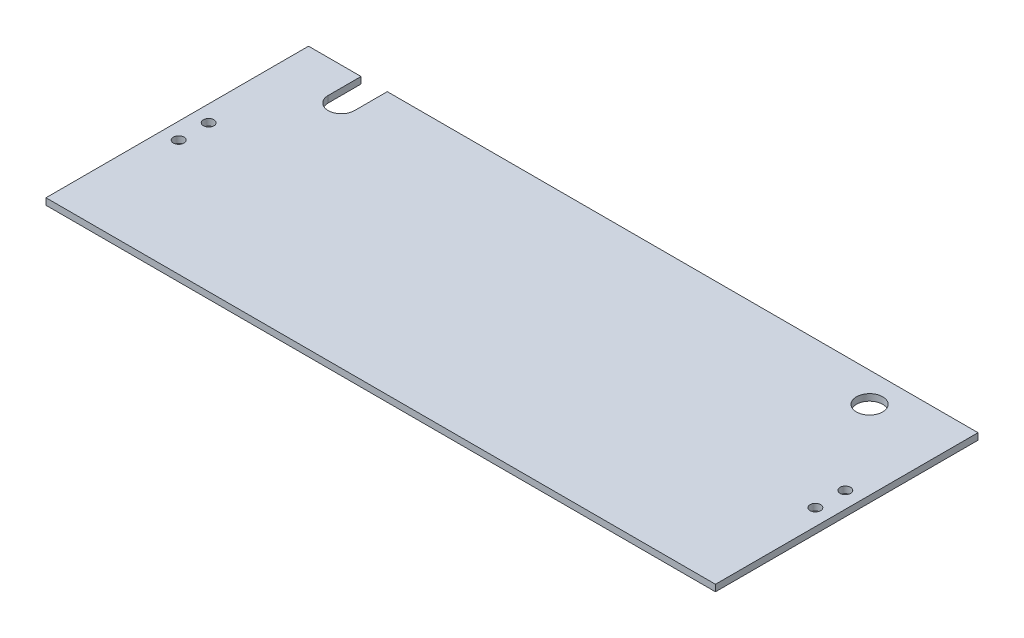
ISO-10303-21;
HEADER;
FILE_DESCRIPTION(('STEP AP214'),'2;1');
FILE_NAME('part.step','',(''),(''),'','','');
FILE_SCHEMA(('AUTOMOTIVE_DESIGN { 1 0 10303 214 1 1 1 1 }'));
ENDSEC;
DATA;
#1=APPLICATION_CONTEXT('core data for automotive mechanical design processes');
#2=APPLICATION_PROTOCOL_DEFINITION('international standard','automotive_design',2000,#1);
#3=PRODUCT_CONTEXT('',#1,'mechanical');
#4=PRODUCT('Part','Part','',(#3));
#5=PRODUCT_RELATED_PRODUCT_CATEGORY('part','',(#4));
#6=PRODUCT_DEFINITION_FORMATION('','',#4);
#7=PRODUCT_DEFINITION_CONTEXT('part definition',#1,'design');
#8=PRODUCT_DEFINITION('design','',#6,#7);
#9=PRODUCT_DEFINITION_SHAPE('','',#8);
#10=(LENGTH_UNIT() NAMED_UNIT(*) SI_UNIT(.MILLI.,.METRE.));
#11=(NAMED_UNIT(*) PLANE_ANGLE_UNIT() SI_UNIT($,.RADIAN.));
#12=(NAMED_UNIT(*) SI_UNIT($,.STERADIAN.) SOLID_ANGLE_UNIT());
#13=UNCERTAINTY_MEASURE_WITH_UNIT(LENGTH_MEASURE(1.E-05),#10,'distance_accuracy_value','');
#14=(GEOMETRIC_REPRESENTATION_CONTEXT(3) GLOBAL_UNCERTAINTY_ASSIGNED_CONTEXT((#13)) GLOBAL_UNIT_ASSIGNED_CONTEXT((#10,
#11,#12)) REPRESENTATION_CONTEXT('',''));
#15=CARTESIAN_POINT('',(0.,0.,0.));
#16=DIRECTION('',(0.,0.,1.));
#17=DIRECTION('',(1.,0.,0.));
#18=AXIS2_PLACEMENT_3D('',#15,#16,#17);
#19=CARTESIAN_POINT('',(0.,3.175,-127.));
#20=DIRECTION('',(0.,0.,1.));
#21=DIRECTION('',(1.,0.,0.));
#22=AXIS2_PLACEMENT_3D('',#19,#20,#21);
#23=PLANE('',#22);
#24=DIRECTION('',(0.,1.,0.));
#25=VECTOR('',#24,1.);
#26=CARTESIAN_POINT('',(25.4,0.,-127.));
#27=LINE('',#26,#25);
#28=CARTESIAN_POINT('',(25.4,0.,-127.));
#29=VERTEX_POINT('',#28);
#30=CARTESIAN_POINT('',(25.4,3.175,-127.));
#31=VERTEX_POINT('',#30);
#32=EDGE_CURVE('E141',#29,#31,#27,.T.);
#33=ORIENTED_EDGE('',*,*,#32,.F.);
#34=DIRECTION('',(-1.,0.,0.));
#35=VECTOR('',#34,1.);
#36=CARTESIAN_POINT('',(0.,0.,-127.));
#37=LINE('',#36,#35);
#38=CARTESIAN_POINT('',(0.,0.,-127.));
#39=VERTEX_POINT('',#38);
#40=EDGE_CURVE('E80',#29,#39,#37,.T.);
#41=ORIENTED_EDGE('',*,*,#40,.T.);
#42=DIRECTION('',(0.,-1.,0.));
#43=VECTOR('',#42,1.);
#44=CARTESIAN_POINT('',(0.,3.175,-127.));
#45=LINE('',#44,#43);
#46=CARTESIAN_POINT('',(0.,3.175,-127.));
#47=VERTEX_POINT('',#46);
#48=EDGE_CURVE('E153',#47,#39,#45,.T.);
#49=ORIENTED_EDGE('',*,*,#48,.F.);
#50=DIRECTION('',(-1.,0.,0.));
#51=VECTOR('',#50,1.);
#52=CARTESIAN_POINT('',(0.,3.175,-127.));
#53=LINE('',#52,#51);
#54=EDGE_CURVE('E58',#31,#47,#53,.T.);
#55=ORIENTED_EDGE('',*,*,#54,.F.);
#56=EDGE_LOOP('',(#33,#41,#49,#55));
#57=FACE_BOUND('',#56,.T.);
#58=ADVANCED_FACE('F33',(#57),#23,.F.);
#59=DIRECTION('',(0.,1.,0.));
#60=VECTOR('',#59,1.);
#61=CARTESIAN_POINT('',(38.1,0.,-127.));
#62=LINE('',#61,#60);
#63=CARTESIAN_POINT('',(38.1,0.,-127.));
#64=VERTEX_POINT('',#63);
#65=CARTESIAN_POINT('',(38.1,3.175,-127.));
#66=VERTEX_POINT('',#65);
#67=EDGE_CURVE('E49',#64,#66,#62,.T.);
#68=ORIENTED_EDGE('',*,*,#67,.T.);
#69=CARTESIAN_POINT('',(323.85,3.175,-127.));
#70=VERTEX_POINT('',#69);
#71=EDGE_CURVE('E150',#70,#66,#53,.T.);
#72=ORIENTED_EDGE('',*,*,#71,.F.);
#73=DIRECTION('',(0.,-1.,0.));
#74=VECTOR('',#73,1.);
#75=CARTESIAN_POINT('',(323.85,3.175,-127.));
#76=LINE('',#75,#74);
#77=CARTESIAN_POINT('',(323.85,0.,-127.));
#78=VERTEX_POINT('',#77);
#79=EDGE_CURVE('E162',#70,#78,#76,.T.);
#80=ORIENTED_EDGE('',*,*,#79,.T.);
#81=EDGE_CURVE('E146',#78,#64,#37,.T.);
#82=ORIENTED_EDGE('',*,*,#81,.T.);
#83=EDGE_LOOP('',(#68,#72,#80,#82));
#84=FACE_BOUND('',#83,.T.);
#85=ADVANCED_FACE('F173',(#84),#23,.F.);
#86=CARTESIAN_POINT('',(0.,3.175,0.));
#87=DIRECTION('',(0.,-1.,0.));
#88=DIRECTION('',(0.,0.,-1.));
#89=AXIS2_PLACEMENT_3D('',#86,#87,#88);
#90=PLANE('',#89);
#91=CARTESIAN_POINT('',(315.9125,3.175,-56.25));
#92=DIRECTION('',(0.,1.,0.));
#93=DIRECTION('',(0.,0.,1.));
#94=AXIS2_PLACEMENT_3D('',#91,#92,#93);
#95=CIRCLE('',#94,2.55270000000002);
#96=CARTESIAN_POINT('',(315.9125,3.175,-53.6973));
#97=VERTEX_POINT('',#96);
#98=EDGE_CURVE('E234',#97,#97,#95,.T.);
#99=ORIENTED_EDGE('',*,*,#98,.F.);
#100=EDGE_LOOP('',(#99));
#101=FACE_BOUND('',#100,.T.);
#102=CARTESIAN_POINT('',(315.9125,3.175,-70.75));
#103=DIRECTION('',(0.,1.,0.));
#104=DIRECTION('',(0.,0.,1.));
#105=AXIS2_PLACEMENT_3D('',#102,#103,#104);
#106=CIRCLE('',#105,2.55270000000002);
#107=CARTESIAN_POINT('',(315.9125,3.175,-68.1973));
#108=VERTEX_POINT('',#107);
#109=EDGE_CURVE('E236',#108,#108,#106,.T.);
#110=ORIENTED_EDGE('',*,*,#109,.F.);
#111=EDGE_LOOP('',(#110));
#112=FACE_BOUND('',#111,.T.);
#113=CARTESIAN_POINT('',(7.93750000000004,3.175,-56.2500000000001));
#114=DIRECTION('',(0.,1.,0.));
#115=DIRECTION('',(0.,0.,1.));
#116=AXIS2_PLACEMENT_3D('',#113,#114,#115);
#117=CIRCLE('',#116,2.5527);
#118=CARTESIAN_POINT('',(7.93750000000004,3.175,-53.6973000000001));
#119=VERTEX_POINT('',#118);
#120=EDGE_CURVE('E244',#119,#119,#117,.T.);
#121=ORIENTED_EDGE('',*,*,#120,.F.);
#122=EDGE_LOOP('',(#121));
#123=FACE_BOUND('',#122,.T.);
#124=CARTESIAN_POINT('',(7.93750000000004,3.175,-70.7500000000001));
#125=DIRECTION('',(0.,1.,0.));
#126=DIRECTION('',(0.,0.,1.));
#127=AXIS2_PLACEMENT_3D('',#124,#125,#126);
#128=CIRCLE('',#127,2.5527);
#129=CARTESIAN_POINT('',(7.93750000000004,3.175,-68.1973000000001));
#130=VERTEX_POINT('',#129);
#131=EDGE_CURVE('E250',#130,#130,#128,.T.);
#132=ORIENTED_EDGE('',*,*,#131,.F.);
#133=EDGE_LOOP('',(#132));
#134=FACE_BOUND('',#133,.T.);
#135=CARTESIAN_POINT('',(285.75,3.175,-112.649));
#136=DIRECTION('',(0.,-1.,0.));
#137=DIRECTION('',(0.,0.,-1.));
#138=AXIS2_PLACEMENT_3D('',#135,#136,#137);
#139=CIRCLE('',#138,6.35);
#140=CARTESIAN_POINT('',(285.75,3.175,-118.999));
#141=VERTEX_POINT('',#140);
#142=EDGE_CURVE('E132',#141,#141,#139,.T.);
#143=ORIENTED_EDGE('',*,*,#142,.T.);
#144=EDGE_LOOP('',(#143));
#145=FACE_BOUND('',#144,.T.);
#146=DIRECTION('',(0.,0.,-1.));
#147=VECTOR('',#146,1.);
#148=CARTESIAN_POINT('',(25.4,3.175,0.));
#149=LINE('',#148,#147);
#150=CARTESIAN_POINT('',(25.4,3.175,-111.125));
#151=VERTEX_POINT('',#150);
#152=EDGE_CURVE('E127',#151,#31,#149,.T.);
#153=ORIENTED_EDGE('',*,*,#152,.T.);
#154=ORIENTED_EDGE('',*,*,#54,.T.);
#155=DIRECTION('',(0.,0.,1.));
#156=VECTOR('',#155,1.);
#157=CARTESIAN_POINT('',(0.,3.175,0.));
#158=LINE('',#157,#156);
#159=CARTESIAN_POINT('',(0.,3.175,0.));
#160=VERTEX_POINT('',#159);
#161=EDGE_CURVE('E144',#47,#160,#158,.T.);
#162=ORIENTED_EDGE('',*,*,#161,.T.);
#163=DIRECTION('',(1.,0.,0.));
#164=VECTOR('',#163,1.);
#165=CARTESIAN_POINT('',(0.,3.175,0.));
#166=LINE('',#165,#164);
#167=CARTESIAN_POINT('',(323.85,3.175,0.));
#168=VERTEX_POINT('',#167);
#169=EDGE_CURVE('E87',#160,#168,#166,.T.);
#170=ORIENTED_EDGE('',*,*,#169,.T.);
#171=DIRECTION('',(0.,0.,-1.));
#172=VECTOR('',#171,1.);
#173=CARTESIAN_POINT('',(323.85,3.175,0.));
#174=LINE('',#173,#172);
#175=EDGE_CURVE('E148',#168,#70,#174,.T.);
#176=ORIENTED_EDGE('',*,*,#175,.T.);
#177=ORIENTED_EDGE('',*,*,#71,.T.);
#178=DIRECTION('',(0.,0.,1.));
#179=VECTOR('',#178,1.);
#180=CARTESIAN_POINT('',(38.1,3.175,0.));
#181=LINE('',#180,#179);
#182=CARTESIAN_POINT('',(38.1,3.175,-111.125));
#183=VERTEX_POINT('',#182);
#184=EDGE_CURVE('E129',#66,#183,#181,.T.);
#185=ORIENTED_EDGE('',*,*,#184,.T.);
#186=CARTESIAN_POINT('',(31.75,3.175,-111.125));
#187=DIRECTION('',(0.,1.,0.));
#188=DIRECTION('',(0.,0.,1.));
#189=AXIS2_PLACEMENT_3D('',#186,#187,#188);
#190=CIRCLE('',#189,6.35);
#191=EDGE_CURVE('E123',#151,#183,#190,.T.);
#192=ORIENTED_EDGE('',*,*,#191,.F.);
#193=EDGE_LOOP('',(#153,#154,#162,#170,#176,#177,#185,#192));
#194=FACE_BOUND('',#193,.T.);
#195=ADVANCED_FACE('F175',(#101,#112,#123,#134,#145,#194),#90,.F.);
#196=CARTESIAN_POINT('',(0.,0.,0.));
#197=DIRECTION('',(0.,-1.,0.));
#198=DIRECTION('',(0.,0.,-1.));
#199=AXIS2_PLACEMENT_3D('',#196,#197,#198);
#200=PLANE('',#199);
#201=CARTESIAN_POINT('',(315.9125,0.,-56.25));
#202=DIRECTION('',(0.,1.,0.));
#203=DIRECTION('',(0.,0.,1.));
#204=AXIS2_PLACEMENT_3D('',#201,#202,#203);
#205=CIRCLE('',#204,2.55270000000002);
#206=CARTESIAN_POINT('',(315.9125,0.,-53.6973));
#207=VERTEX_POINT('',#206);
#208=EDGE_CURVE('E231',#207,#207,#205,.T.);
#209=ORIENTED_EDGE('',*,*,#208,.T.);
#210=EDGE_LOOP('',(#209));
#211=FACE_BOUND('',#210,.T.);
#212=CARTESIAN_POINT('',(315.9125,0.,-70.75));
#213=DIRECTION('',(0.,1.,0.));
#214=DIRECTION('',(0.,0.,1.));
#215=AXIS2_PLACEMENT_3D('',#212,#213,#214);
#216=CIRCLE('',#215,2.55270000000002);
#217=CARTESIAN_POINT('',(315.9125,0.,-68.1973));
#218=VERTEX_POINT('',#217);
#219=EDGE_CURVE('E241',#218,#218,#216,.T.);
#220=ORIENTED_EDGE('',*,*,#219,.T.);
#221=EDGE_LOOP('',(#220));
#222=FACE_BOUND('',#221,.T.);
#223=CARTESIAN_POINT('',(7.93750000000004,0.,-56.2500000000001));
#224=DIRECTION('',(0.,1.,0.));
#225=DIRECTION('',(0.,0.,1.));
#226=AXIS2_PLACEMENT_3D('',#223,#224,#225);
#227=CIRCLE('',#226,2.5527);
#228=CARTESIAN_POINT('',(7.93750000000004,0.,-53.6973000000001));
#229=VERTEX_POINT('',#228);
#230=EDGE_CURVE('E247',#229,#229,#227,.T.);
#231=ORIENTED_EDGE('',*,*,#230,.T.);
#232=EDGE_LOOP('',(#231));
#233=FACE_BOUND('',#232,.T.);
#234=CARTESIAN_POINT('',(7.93750000000004,0.,-70.7500000000001));
#235=DIRECTION('',(0.,1.,0.));
#236=DIRECTION('',(0.,0.,1.));
#237=AXIS2_PLACEMENT_3D('',#234,#235,#236);
#238=CIRCLE('',#237,2.5527);
#239=CARTESIAN_POINT('',(7.93750000000004,0.,-68.1973000000001));
#240=VERTEX_POINT('',#239);
#241=EDGE_CURVE('E252',#240,#240,#238,.T.);
#242=ORIENTED_EDGE('',*,*,#241,.T.);
#243=EDGE_LOOP('',(#242));
#244=FACE_BOUND('',#243,.T.);
#245=CARTESIAN_POINT('',(285.75,0.,-112.649));
#246=DIRECTION('',(0.,-1.,0.));
#247=DIRECTION('',(0.,0.,-1.));
#248=AXIS2_PLACEMENT_3D('',#245,#246,#247);
#249=CIRCLE('',#248,6.35);
#250=CARTESIAN_POINT('',(285.75,0.,-118.999));
#251=VERTEX_POINT('',#250);
#252=EDGE_CURVE('E37',#251,#251,#249,.T.);
#253=ORIENTED_EDGE('',*,*,#252,.F.);
#254=EDGE_LOOP('',(#253));
#255=FACE_BOUND('',#254,.T.);
#256=ORIENTED_EDGE('',*,*,#40,.F.);
#257=DIRECTION('',(0.,0.,-1.));
#258=VECTOR('',#257,1.);
#259=CARTESIAN_POINT('',(25.4,0.,0.));
#260=LINE('',#259,#258);
#261=CARTESIAN_POINT('',(25.4,0.,-111.125));
#262=VERTEX_POINT('',#261);
#263=EDGE_CURVE('E115',#262,#29,#260,.T.);
#264=ORIENTED_EDGE('',*,*,#263,.F.);
#265=CARTESIAN_POINT('',(31.75,0.,-111.125));
#266=DIRECTION('',(0.,1.,0.));
#267=DIRECTION('',(0.,0.,1.));
#268=AXIS2_PLACEMENT_3D('',#265,#266,#267);
#269=CIRCLE('',#268,6.35);
#270=CARTESIAN_POINT('',(38.1,0.,-111.125));
#271=VERTEX_POINT('',#270);
#272=EDGE_CURVE('E116',#262,#271,#269,.T.);
#273=ORIENTED_EDGE('',*,*,#272,.T.);
#274=DIRECTION('',(0.,0.,1.));
#275=VECTOR('',#274,1.);
#276=CARTESIAN_POINT('',(38.1,0.,0.));
#277=LINE('',#276,#275);
#278=EDGE_CURVE('E106',#64,#271,#277,.T.);
#279=ORIENTED_EDGE('',*,*,#278,.F.);
#280=ORIENTED_EDGE('',*,*,#81,.F.);
#281=DIRECTION('',(0.,0.,-1.));
#282=VECTOR('',#281,1.);
#283=CARTESIAN_POINT('',(323.85,0.,0.));
#284=LINE('',#283,#282);
#285=CARTESIAN_POINT('',(323.85,0.,0.));
#286=VERTEX_POINT('',#285);
#287=EDGE_CURVE('E158',#286,#78,#284,.T.);
#288=ORIENTED_EDGE('',*,*,#287,.F.);
#289=DIRECTION('',(1.,0.,0.));
#290=VECTOR('',#289,1.);
#291=CARTESIAN_POINT('',(0.,0.,0.));
#292=LINE('',#291,#290);
#293=CARTESIAN_POINT('',(0.,0.,0.));
#294=VERTEX_POINT('',#293);
#295=EDGE_CURVE('E156',#294,#286,#292,.T.);
#296=ORIENTED_EDGE('',*,*,#295,.F.);
#297=DIRECTION('',(0.,0.,1.));
#298=VECTOR('',#297,1.);
#299=CARTESIAN_POINT('',(0.,0.,0.));
#300=LINE('',#299,#298);
#301=EDGE_CURVE('E140',#39,#294,#300,.T.);
#302=ORIENTED_EDGE('',*,*,#301,.F.);
#303=EDGE_LOOP('',(#256,#264,#273,#279,#280,#288,#296,#302));
#304=FACE_BOUND('',#303,.T.);
#305=ADVANCED_FACE('F126',(#211,#222,#233,#244,#255,#304),#200,.T.);
#306=CARTESIAN_POINT('',(0.,3.175,0.));
#307=DIRECTION('',(1.,0.,0.));
#308=DIRECTION('',(0.,0.,-1.));
#309=AXIS2_PLACEMENT_3D('',#306,#307,#308);
#310=PLANE('',#309);
#311=ORIENTED_EDGE('',*,*,#301,.T.);
#312=DIRECTION('',(0.,-1.,0.));
#313=VECTOR('',#312,1.);
#314=CARTESIAN_POINT('',(0.,3.175,0.));
#315=LINE('',#314,#313);
#316=EDGE_CURVE('E11',#160,#294,#315,.T.);
#317=ORIENTED_EDGE('',*,*,#316,.F.);
#318=ORIENTED_EDGE('',*,*,#161,.F.);
#319=ORIENTED_EDGE('',*,*,#48,.T.);
#320=EDGE_LOOP('',(#311,#317,#318,#319));
#321=FACE_BOUND('',#320,.T.);
#322=ADVANCED_FACE('F35',(#321),#310,.F.);
#323=CARTESIAN_POINT('',(0.,3.175,0.));
#324=DIRECTION('',(0.,0.,-1.));
#325=DIRECTION('',(-1.,0.,0.));
#326=AXIS2_PLACEMENT_3D('',#323,#324,#325);
#327=PLANE('',#326);
#328=ORIENTED_EDGE('',*,*,#295,.T.);
#329=DIRECTION('',(0.,-1.,0.));
#330=VECTOR('',#329,1.);
#331=CARTESIAN_POINT('',(323.85,3.175,0.));
#332=LINE('',#331,#330);
#333=EDGE_CURVE('E42',#168,#286,#332,.T.);
#334=ORIENTED_EDGE('',*,*,#333,.F.);
#335=ORIENTED_EDGE('',*,*,#169,.F.);
#336=ORIENTED_EDGE('',*,*,#316,.T.);
#337=EDGE_LOOP('',(#328,#334,#335,#336));
#338=FACE_BOUND('',#337,.T.);
#339=ADVANCED_FACE('F179',(#338),#327,.F.);
#340=CARTESIAN_POINT('',(323.85,3.175,0.));
#341=DIRECTION('',(-1.,0.,0.));
#342=DIRECTION('',(0.,0.,1.));
#343=AXIS2_PLACEMENT_3D('',#340,#341,#342);
#344=PLANE('',#343);
#345=ORIENTED_EDGE('',*,*,#287,.T.);
#346=ORIENTED_EDGE('',*,*,#79,.F.);
#347=ORIENTED_EDGE('',*,*,#175,.F.);
#348=ORIENTED_EDGE('',*,*,#333,.T.);
#349=EDGE_LOOP('',(#345,#346,#347,#348));
#350=FACE_BOUND('',#349,.T.);
#351=ADVANCED_FACE('F169',(#350),#344,.F.);
#352=CARTESIAN_POINT('',(31.75,0.,-111.125));
#353=DIRECTION('',(0.,1.,0.));
#354=DIRECTION('',(0.,0.,1.));
#355=AXIS2_PLACEMENT_3D('',#352,#353,#354);
#356=CYLINDRICAL_SURFACE('',#355,6.35);
#357=ORIENTED_EDGE('',*,*,#191,.T.);
#358=DIRECTION('',(0.,1.,0.));
#359=VECTOR('',#358,1.);
#360=CARTESIAN_POINT('',(38.1,0.,-111.125));
#361=LINE('',#360,#359);
#362=EDGE_CURVE('E109',#271,#183,#361,.T.);
#363=ORIENTED_EDGE('',*,*,#362,.F.);
#364=ORIENTED_EDGE('',*,*,#272,.F.);
#365=DIRECTION('',(0.,1.,0.));
#366=VECTOR('',#365,1.);
#367=CARTESIAN_POINT('',(25.4,0.,-111.125));
#368=LINE('',#367,#366);
#369=EDGE_CURVE('E138',#262,#151,#368,.T.);
#370=ORIENTED_EDGE('',*,*,#369,.T.);
#371=EDGE_LOOP('',(#357,#363,#364,#370));
#372=FACE_BOUND('',#371,.T.);
#373=ADVANCED_FACE('F120',(#372),#356,.F.);
#374=CARTESIAN_POINT('',(25.4,0.,0.));
#375=DIRECTION('',(1.,0.,0.));
#376=DIRECTION('',(0.,0.,-1.));
#377=AXIS2_PLACEMENT_3D('',#374,#375,#376);
#378=PLANE('',#377);
#379=ORIENTED_EDGE('',*,*,#152,.F.);
#380=ORIENTED_EDGE('',*,*,#369,.F.);
#381=ORIENTED_EDGE('',*,*,#263,.T.);
#382=ORIENTED_EDGE('',*,*,#32,.T.);
#383=EDGE_LOOP('',(#379,#380,#381,#382));
#384=FACE_BOUND('',#383,.T.);
#385=ADVANCED_FACE('F201',(#384),#378,.T.);
#386=CARTESIAN_POINT('',(38.1,0.,0.));
#387=DIRECTION('',(-1.,0.,0.));
#388=DIRECTION('',(0.,0.,1.));
#389=AXIS2_PLACEMENT_3D('',#386,#387,#388);
#390=PLANE('',#389);
#391=ORIENTED_EDGE('',*,*,#184,.F.);
#392=ORIENTED_EDGE('',*,*,#67,.F.);
#393=ORIENTED_EDGE('',*,*,#278,.T.);
#394=ORIENTED_EDGE('',*,*,#362,.T.);
#395=EDGE_LOOP('',(#391,#392,#393,#394));
#396=FACE_BOUND('',#395,.T.);
#397=ADVANCED_FACE('F108',(#396),#390,.T.);
#398=CARTESIAN_POINT('',(285.75,3.175,-112.649));
#399=DIRECTION('',(0.,-1.,0.));
#400=DIRECTION('',(0.,0.,-1.));
#401=AXIS2_PLACEMENT_3D('',#398,#399,#400);
#402=CYLINDRICAL_SURFACE('',#401,6.35);
#403=ORIENTED_EDGE('',*,*,#252,.T.);
#404=EDGE_LOOP('',(#403));
#405=FACE_BOUND('',#404,.T.);
#406=ORIENTED_EDGE('',*,*,#142,.F.);
#407=EDGE_LOOP('',(#406));
#408=FACE_BOUND('',#407,.T.);
#409=ADVANCED_FACE('F204',(#405,#408),#402,.F.);
#410=CARTESIAN_POINT('',(7.93750000000004,3.175,-70.7500000000001));
#411=DIRECTION('',(0.,1.,0.));
#412=DIRECTION('',(0.,0.,1.));
#413=AXIS2_PLACEMENT_3D('',#410,#411,#412);
#414=CYLINDRICAL_SURFACE('',#413,2.5527);
#415=ORIENTED_EDGE('',*,*,#241,.F.);
#416=EDGE_LOOP('',(#415));
#417=FACE_BOUND('',#416,.T.);
#418=ORIENTED_EDGE('',*,*,#131,.T.);
#419=EDGE_LOOP('',(#418));
#420=FACE_BOUND('',#419,.T.);
#421=ADVANCED_FACE('F210',(#417,#420),#414,.F.);
#422=CARTESIAN_POINT('',(7.93750000000004,3.175,-56.2500000000001));
#423=DIRECTION('',(0.,1.,0.));
#424=DIRECTION('',(0.,0.,1.));
#425=AXIS2_PLACEMENT_3D('',#422,#423,#424);
#426=CYLINDRICAL_SURFACE('',#425,2.5527);
#427=ORIENTED_EDGE('',*,*,#230,.F.);
#428=EDGE_LOOP('',(#427));
#429=FACE_BOUND('',#428,.T.);
#430=ORIENTED_EDGE('',*,*,#120,.T.);
#431=EDGE_LOOP('',(#430));
#432=FACE_BOUND('',#431,.T.);
#433=ADVANCED_FACE('F214',(#429,#432),#426,.F.);
#434=CARTESIAN_POINT('',(315.9125,3.175,-70.75));
#435=DIRECTION('',(0.,1.,0.));
#436=DIRECTION('',(0.,0.,1.));
#437=AXIS2_PLACEMENT_3D('',#434,#435,#436);
#438=CYLINDRICAL_SURFACE('',#437,2.55270000000002);
#439=ORIENTED_EDGE('',*,*,#219,.F.);
#440=EDGE_LOOP('',(#439));
#441=FACE_BOUND('',#440,.T.);
#442=ORIENTED_EDGE('',*,*,#109,.T.);
#443=EDGE_LOOP('',(#442));
#444=FACE_BOUND('',#443,.T.);
#445=ADVANCED_FACE('F218',(#441,#444),#438,.F.);
#446=CARTESIAN_POINT('',(315.9125,3.175,-56.25));
#447=DIRECTION('',(0.,1.,0.));
#448=DIRECTION('',(0.,0.,1.));
#449=AXIS2_PLACEMENT_3D('',#446,#447,#448);
#450=CYLINDRICAL_SURFACE('',#449,2.55270000000002);
#451=ORIENTED_EDGE('',*,*,#208,.F.);
#452=EDGE_LOOP('',(#451));
#453=FACE_BOUND('',#452,.T.);
#454=ORIENTED_EDGE('',*,*,#98,.T.);
#455=EDGE_LOOP('',(#454));
#456=FACE_BOUND('',#455,.T.);
#457=ADVANCED_FACE('F222',(#453,#456),#450,.F.);
#458=CLOSED_SHELL('',(#58,#85,#195,#305,#322,#339,#351,#373,#385,#397,#409,#421,#433,#445,#457));
#459=MANIFOLD_SOLID_BREP('B2',#458);
#460=ADVANCED_BREP_SHAPE_REPRESENTATION('',(#18,#459),#14);
#461=SHAPE_DEFINITION_REPRESENTATION(#9,#460);
ENDSEC;
END-ISO-10303-21;
